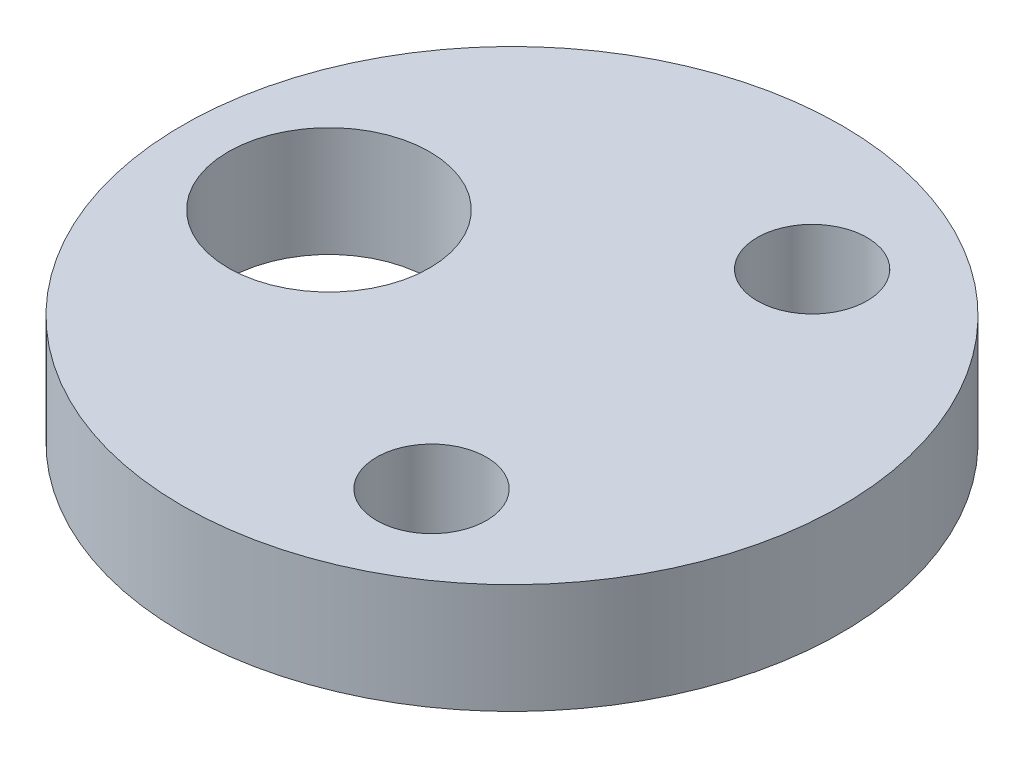
ISO-10303-21;
HEADER;
FILE_DESCRIPTION(('STEP AP214'),'2;1');
FILE_NAME('part.step','',(''),(''),'','','');
FILE_SCHEMA(('AUTOMOTIVE_DESIGN { 1 0 10303 214 1 1 1 1 }'));
ENDSEC;
DATA;
#1=APPLICATION_CONTEXT('core data for automotive mechanical design processes');
#2=APPLICATION_PROTOCOL_DEFINITION('international standard','automotive_design',2000,#1);
#3=PRODUCT_CONTEXT('',#1,'mechanical');
#4=PRODUCT('Part','Part','',(#3));
#5=PRODUCT_RELATED_PRODUCT_CATEGORY('part','',(#4));
#6=PRODUCT_DEFINITION_FORMATION('','',#4);
#7=PRODUCT_DEFINITION_CONTEXT('part definition',#1,'design');
#8=PRODUCT_DEFINITION('design','',#6,#7);
#9=PRODUCT_DEFINITION_SHAPE('','',#8);
#10=(LENGTH_UNIT() NAMED_UNIT(*) SI_UNIT(.MILLI.,.METRE.));
#11=(NAMED_UNIT(*) PLANE_ANGLE_UNIT() SI_UNIT($,.RADIAN.));
#12=(NAMED_UNIT(*) SI_UNIT($,.STERADIAN.) SOLID_ANGLE_UNIT());
#13=UNCERTAINTY_MEASURE_WITH_UNIT(LENGTH_MEASURE(1.E-05),#10,'distance_accuracy_value','');
#14=(GEOMETRIC_REPRESENTATION_CONTEXT(3) GLOBAL_UNCERTAINTY_ASSIGNED_CONTEXT((#13)) GLOBAL_UNIT_ASSIGNED_CONTEXT((#10,
#11,#12)) REPRESENTATION_CONTEXT('',''));
#15=CARTESIAN_POINT('',(0.,0.,0.));
#16=DIRECTION('',(0.,0.,1.));
#17=DIRECTION('',(1.,0.,0.));
#18=AXIS2_PLACEMENT_3D('',#15,#16,#17);
#19=CARTESIAN_POINT('',(0.,3.,0.));
#20=DIRECTION('',(0.,1.,0.));
#21=DIRECTION('',(0.,0.,1.));
#22=AXIS2_PLACEMENT_3D('',#19,#20,#21);
#23=PLANE('',#22);
#24=CARTESIAN_POINT('',(3.00086795720222,3.,-5.19565121071821));
#25=DIRECTION('',(0.,1.,0.));
#26=DIRECTION('',(0.,0.,1.));
#27=AXIS2_PLACEMENT_3D('',#24,#25,#26);
#28=CIRCLE('',#27,1.5);
#29=CARTESIAN_POINT('',(3.00086795720222,3.,-3.6956512107182));
#30=VERTEX_POINT('',#29);
#31=EDGE_CURVE('E62',#30,#30,#28,.T.);
#32=ORIENTED_EDGE('',*,*,#31,.F.);
#33=EDGE_LOOP('',(#32));
#34=FACE_BOUND('',#33,.T.);
#35=CARTESIAN_POINT('',(0.,3.,0.));
#36=DIRECTION('',(0.,1.,0.));
#37=DIRECTION('',(0.,0.,1.));
#38=AXIS2_PLACEMENT_3D('',#35,#36,#37);
#39=CIRCLE('',#38,9.);
#40=CARTESIAN_POINT('',(0.,3.,9.));
#41=VERTEX_POINT('',#40);
#42=EDGE_CURVE('E10',#41,#41,#39,.T.);
#43=ORIENTED_EDGE('',*,*,#42,.T.);
#44=EDGE_LOOP('',(#43));
#45=FACE_BOUND('',#44,.T.);
#46=CARTESIAN_POINT('',(2.99913195908438,3.,5.19665348969885));
#47=DIRECTION('',(0.,1.,0.));
#48=DIRECTION('',(0.,0.,1.));
#49=AXIS2_PLACEMENT_3D('',#46,#47,#48);
#50=CIRCLE('',#49,1.5);
#51=CARTESIAN_POINT('',(2.99913195908438,3.,6.69665348969885));
#52=VERTEX_POINT('',#51);
#53=EDGE_CURVE('E56',#52,#52,#50,.T.);
#54=ORIENTED_EDGE('',*,*,#53,.F.);
#55=EDGE_LOOP('',(#54));
#56=FACE_BOUND('',#55,.T.);
#57=CARTESIAN_POINT('',(-4.9999999999999,3.,-0.000835232483875));
#58=DIRECTION('',(0.,1.,0.));
#59=DIRECTION('',(0.,0.,1.));
#60=AXIS2_PLACEMENT_3D('',#57,#58,#59);
#61=CIRCLE('',#60,2.75);
#62=CARTESIAN_POINT('',(-4.9999999999999,3.,2.74916476751612));
#63=VERTEX_POINT('',#62);
#64=EDGE_CURVE('E70',#63,#63,#61,.T.);
#65=ORIENTED_EDGE('',*,*,#64,.F.);
#66=EDGE_LOOP('',(#65));
#67=FACE_BOUND('',#66,.T.);
#68=ADVANCED_FACE('F43',(#34,#45,#56,#67),#23,.T.);
#69=CARTESIAN_POINT('',(0.,0.,0.));
#70=DIRECTION('',(0.,1.,0.));
#71=DIRECTION('',(0.,0.,1.));
#72=AXIS2_PLACEMENT_3D('',#69,#70,#71);
#73=PLANE('',#72);
#74=CARTESIAN_POINT('',(0.,0.,0.));
#75=DIRECTION('',(0.,1.,0.));
#76=DIRECTION('',(0.,0.,1.));
#77=AXIS2_PLACEMENT_3D('',#74,#75,#76);
#78=CIRCLE('',#77,9.);
#79=CARTESIAN_POINT('',(0.,0.,9.));
#80=VERTEX_POINT('',#79);
#81=EDGE_CURVE('E47',#80,#80,#78,.T.);
#82=ORIENTED_EDGE('',*,*,#81,.F.);
#83=EDGE_LOOP('',(#82));
#84=FACE_BOUND('',#83,.T.);
#85=CARTESIAN_POINT('',(2.99913195908438,0.,5.19665348969885));
#86=DIRECTION('',(0.,1.,0.));
#87=DIRECTION('',(0.,0.,1.));
#88=AXIS2_PLACEMENT_3D('',#85,#86,#87);
#89=CIRCLE('',#88,1.5);
#90=CARTESIAN_POINT('',(2.99913195908438,0.,6.69665348969885));
#91=VERTEX_POINT('',#90);
#92=EDGE_CURVE('E58',#91,#91,#89,.T.);
#93=ORIENTED_EDGE('',*,*,#92,.T.);
#94=EDGE_LOOP('',(#93));
#95=FACE_BOUND('',#94,.T.);
#96=CARTESIAN_POINT('',(3.00086795720222,0.,-5.19565121071821));
#97=DIRECTION('',(0.,1.,0.));
#98=DIRECTION('',(0.,0.,1.));
#99=AXIS2_PLACEMENT_3D('',#96,#97,#98);
#100=CIRCLE('',#99,1.5);
#101=CARTESIAN_POINT('',(3.00086795720222,0.,-3.6956512107182));
#102=VERTEX_POINT('',#101);
#103=EDGE_CURVE('E66',#102,#102,#100,.T.);
#104=ORIENTED_EDGE('',*,*,#103,.T.);
#105=EDGE_LOOP('',(#104));
#106=FACE_BOUND('',#105,.T.);
#107=CARTESIAN_POINT('',(-4.9999999999999,0.,-0.000835232483875));
#108=DIRECTION('',(0.,1.,0.));
#109=DIRECTION('',(0.,0.,1.));
#110=AXIS2_PLACEMENT_3D('',#107,#108,#109);
#111=CIRCLE('',#110,2.75);
#112=CARTESIAN_POINT('',(-4.9999999999999,0.,2.74916476751612));
#113=VERTEX_POINT('',#112);
#114=EDGE_CURVE('E74',#113,#113,#111,.T.);
#115=ORIENTED_EDGE('',*,*,#114,.T.);
#116=EDGE_LOOP('',(#115));
#117=FACE_BOUND('',#116,.T.);
#118=ADVANCED_FACE('F86',(#84,#95,#106,#117),#73,.F.);
#119=CARTESIAN_POINT('',(0.,3.,0.));
#120=DIRECTION('',(0.,-1.,0.));
#121=DIRECTION('',(0.,0.,-1.));
#122=AXIS2_PLACEMENT_3D('',#119,#120,#121);
#123=CYLINDRICAL_SURFACE('',#122,9.);
#124=ORIENTED_EDGE('',*,*,#42,.F.);
#125=EDGE_LOOP('',(#124));
#126=FACE_BOUND('',#125,.T.);
#127=ORIENTED_EDGE('',*,*,#81,.T.);
#128=EDGE_LOOP('',(#127));
#129=FACE_BOUND('',#128,.T.);
#130=ADVANCED_FACE('F45',(#126,#129),#123,.T.);
#131=CARTESIAN_POINT('',(2.99913195908438,3.,5.19665348969885));
#132=DIRECTION('',(0.,-1.,0.));
#133=DIRECTION('',(0.,0.,-1.));
#134=AXIS2_PLACEMENT_3D('',#131,#132,#133);
#135=CYLINDRICAL_SURFACE('',#134,1.5);
#136=ORIENTED_EDGE('',*,*,#53,.T.);
#137=EDGE_LOOP('',(#136));
#138=FACE_BOUND('',#137,.T.);
#139=ORIENTED_EDGE('',*,*,#92,.F.);
#140=EDGE_LOOP('',(#139));
#141=FACE_BOUND('',#140,.T.);
#142=ADVANCED_FACE('F95',(#138,#141),#135,.F.);
#143=CARTESIAN_POINT('',(3.00086795720222,3.,-5.19565121071821));
#144=DIRECTION('',(0.,-1.,0.));
#145=DIRECTION('',(0.,0.,-1.));
#146=AXIS2_PLACEMENT_3D('',#143,#144,#145);
#147=CYLINDRICAL_SURFACE('',#146,1.5);
#148=ORIENTED_EDGE('',*,*,#31,.T.);
#149=EDGE_LOOP('',(#148));
#150=FACE_BOUND('',#149,.T.);
#151=ORIENTED_EDGE('',*,*,#103,.F.);
#152=EDGE_LOOP('',(#151));
#153=FACE_BOUND('',#152,.T.);
#154=ADVANCED_FACE('F98',(#150,#153),#147,.F.);
#155=CARTESIAN_POINT('',(-4.9999999999999,3.,-0.000835232483875));
#156=DIRECTION('',(0.,-1.,0.));
#157=DIRECTION('',(0.,0.,-1.));
#158=AXIS2_PLACEMENT_3D('',#155,#156,#157);
#159=CYLINDRICAL_SURFACE('',#158,2.75);
#160=ORIENTED_EDGE('',*,*,#64,.T.);
#161=EDGE_LOOP('',(#160));
#162=FACE_BOUND('',#161,.T.);
#163=ORIENTED_EDGE('',*,*,#114,.F.);
#164=EDGE_LOOP('',(#163));
#165=FACE_BOUND('',#164,.T.);
#166=ADVANCED_FACE('F82',(#162,#165),#159,.F.);
#167=CLOSED_SHELL('',(#68,#118,#130,#142,#154,#166));
#168=MANIFOLD_SOLID_BREP('B2',#167);
#169=ADVANCED_BREP_SHAPE_REPRESENTATION('',(#18,#168),#14);
#170=SHAPE_DEFINITION_REPRESENTATION(#9,#169);
ENDSEC;
END-ISO-10303-21;
